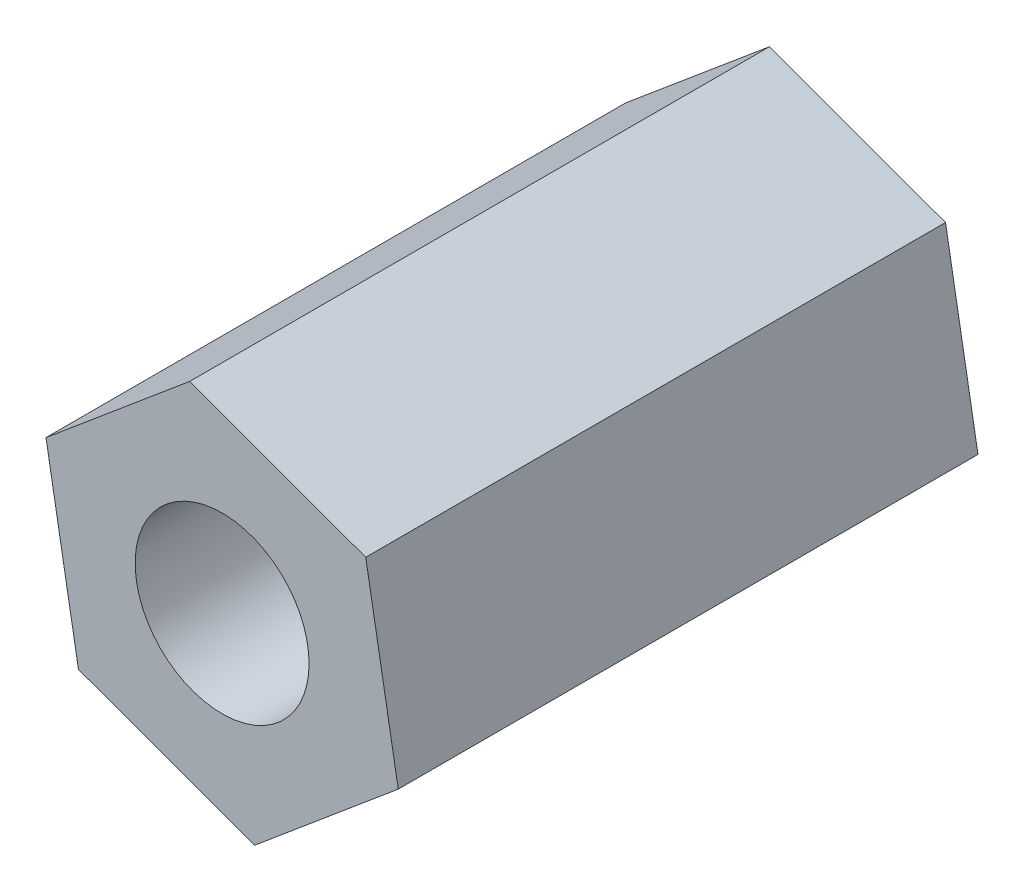
ISO-10303-21;
HEADER;
FILE_DESCRIPTION(('STEP AP214'),'2;1');
FILE_NAME('part.step','',(''),(''),'','','');
FILE_SCHEMA(('AUTOMOTIVE_DESIGN { 1 0 10303 214 1 1 1 1 }'));
ENDSEC;
DATA;
#1=APPLICATION_CONTEXT('core data for automotive mechanical design processes');
#2=APPLICATION_PROTOCOL_DEFINITION('international standard','automotive_design',2000,#1);
#3=PRODUCT_CONTEXT('',#1,'mechanical');
#4=PRODUCT('Part','Part','',(#3));
#5=PRODUCT_RELATED_PRODUCT_CATEGORY('part','',(#4));
#6=PRODUCT_DEFINITION_FORMATION('','',#4);
#7=PRODUCT_DEFINITION_CONTEXT('part definition',#1,'design');
#8=PRODUCT_DEFINITION('design','',#6,#7);
#9=PRODUCT_DEFINITION_SHAPE('','',#8);
#10=(LENGTH_UNIT() NAMED_UNIT(*) SI_UNIT(.MILLI.,.METRE.));
#11=(NAMED_UNIT(*) PLANE_ANGLE_UNIT() SI_UNIT($,.RADIAN.));
#12=(NAMED_UNIT(*) SI_UNIT($,.STERADIAN.) SOLID_ANGLE_UNIT());
#13=UNCERTAINTY_MEASURE_WITH_UNIT(LENGTH_MEASURE(1.E-05),#10,'distance_accuracy_value','');
#14=(GEOMETRIC_REPRESENTATION_CONTEXT(3) GLOBAL_UNCERTAINTY_ASSIGNED_CONTEXT((#13)) GLOBAL_UNIT_ASSIGNED_CONTEXT((#10,
#11,#12)) REPRESENTATION_CONTEXT('',''));
#15=CARTESIAN_POINT('',(0.,0.,0.));
#16=DIRECTION('',(0.,0.,1.));
#17=DIRECTION('',(1.,0.,0.));
#18=AXIS2_PLACEMENT_3D('',#15,#16,#17);
#19=CARTESIAN_POINT('',(0.,0.,10.));
#20=DIRECTION('',(0.,0.,1.));
#21=DIRECTION('',(1.,0.,0.));
#22=AXIS2_PLACEMENT_3D('',#19,#20,#21);
#23=PLANE('',#22);
#24=DIRECTION('',(0.939548933565756,-0.342414662997147,0.));
#25=VECTOR('',#24,1.);
#26=CARTESIAN_POINT('',(-132.779270137483,-55.9793424510125,10.));
#27=LINE('',#26,#25);
#28=CARTESIAN_POINT('',(-132.779270137483,-55.9793424510125,10.));
#29=VERTEX_POINT('',#28);
#30=CARTESIAN_POINT('',(-129.741556691102,-57.0864243590054,10.));
#31=VERTEX_POINT('',#30);
#32=EDGE_CURVE('E135',#29,#31,#27,.T.);
#33=ORIENTED_EDGE('',*,*,#32,.T.);
#34=DIRECTION('',(0.766314263566697,0.642465913067947,0.));
#35=VECTOR('',#34,1.);
#36=CARTESIAN_POINT('',(-129.741556691102,-57.0864243590054,10.));
#37=LINE('',#36,#35);
#38=CARTESIAN_POINT('',(-127.263938911519,-55.0092282990178,10.));
#39=VERTEX_POINT('',#38);
#40=EDGE_CURVE('E93',#31,#39,#37,.T.);
#41=ORIENTED_EDGE('',*,*,#40,.T.);
#42=DIRECTION('',(-0.173234669999057,0.984880576065097,0.));
#43=VECTOR('',#42,1.);
#44=CARTESIAN_POINT('',(-127.263938911519,-55.0092282990178,10.));
#45=LINE('',#44,#43);
#46=CARTESIAN_POINT('',(-127.824034578318,-51.8249503310372,10.));
#47=VERTEX_POINT('',#46);
#48=EDGE_CURVE('E106',#39,#47,#45,.T.);
#49=ORIENTED_EDGE('',*,*,#48,.T.);
#50=DIRECTION('',(-0.939548933565756,0.342414662997149,0.));
#51=VECTOR('',#50,1.);
#52=CARTESIAN_POINT('',(-127.824034578318,-51.8249503310372,10.));
#53=LINE('',#52,#51);
#54=CARTESIAN_POINT('',(-130.861748024699,-50.7178684230442,10.));
#55=VERTEX_POINT('',#54);
#56=EDGE_CURVE('E100',#47,#55,#53,.T.);
#57=ORIENTED_EDGE('',*,*,#56,.T.);
#58=DIRECTION('',(-0.766314263566692,-0.642465913067953,0.));
#59=VECTOR('',#58,1.);
#60=CARTESIAN_POINT('',(-130.861748024699,-50.7178684230442,10.));
#61=LINE('',#60,#59);
#62=CARTESIAN_POINT('',(-133.339365804282,-52.7950644830319,10.));
#63=VERTEX_POINT('',#62);
#64=EDGE_CURVE('E104',#55,#63,#61,.T.);
#65=ORIENTED_EDGE('',*,*,#64,.T.);
#66=DIRECTION('',(0.173234669999058,-0.984880576065097,0.));
#67=VECTOR('',#66,1.);
#68=CARTESIAN_POINT('',(-133.339365804282,-52.7950644830319,10.));
#69=LINE('',#68,#67);
#70=EDGE_CURVE('E56',#63,#29,#69,.T.);
#71=ORIENTED_EDGE('',*,*,#70,.T.);
#72=EDGE_LOOP('',(#33,#41,#49,#57,#65,#71));
#73=FACE_BOUND('',#72,.T.);
#74=CARTESIAN_POINT('',(-130.301652357901,-53.9021463910248,10.));
#75=DIRECTION('',(0.,0.,1.));
#76=DIRECTION('',(1.,0.,0.));
#77=AXIS2_PLACEMENT_3D('',#74,#75,#76);
#78=CIRCLE('',#77,1.5);
#79=CARTESIAN_POINT('',(-128.801652357901,-53.9021463910248,10.));
#80=VERTEX_POINT('',#79);
#81=EDGE_CURVE('E128',#80,#80,#78,.T.);
#82=ORIENTED_EDGE('',*,*,#81,.F.);
#83=EDGE_LOOP('',(#82));
#84=FACE_BOUND('',#83,.T.);
#85=ADVANCED_FACE('F39',(#73,#84),#23,.T.);
#86=CARTESIAN_POINT('',(0.,0.,0.));
#87=DIRECTION('',(0.,0.,1.));
#88=DIRECTION('',(1.,0.,0.));
#89=AXIS2_PLACEMENT_3D('',#86,#87,#88);
#90=PLANE('',#89);
#91=DIRECTION('',(0.939548933565756,-0.342414662997147,0.));
#92=VECTOR('',#91,1.);
#93=CARTESIAN_POINT('',(-132.779270137483,-55.9793424510125,0.));
#94=LINE('',#93,#92);
#95=CARTESIAN_POINT('',(-132.779270137483,-55.9793424510125,0.));
#96=VERTEX_POINT('',#95);
#97=CARTESIAN_POINT('',(-129.741556691102,-57.0864243590054,0.));
#98=VERTEX_POINT('',#97);
#99=EDGE_CURVE('E124',#96,#98,#94,.T.);
#100=ORIENTED_EDGE('',*,*,#99,.F.);
#101=DIRECTION('',(0.173234669999058,-0.984880576065097,0.));
#102=VECTOR('',#101,1.);
#103=CARTESIAN_POINT('',(-133.339365804282,-52.7950644830319,0.));
#104=LINE('',#103,#102);
#105=CARTESIAN_POINT('',(-133.339365804282,-52.7950644830319,0.));
#106=VERTEX_POINT('',#105);
#107=EDGE_CURVE('E85',#106,#96,#104,.T.);
#108=ORIENTED_EDGE('',*,*,#107,.F.);
#109=DIRECTION('',(-0.766314263566692,-0.642465913067953,0.));
#110=VECTOR('',#109,1.);
#111=CARTESIAN_POINT('',(-130.861748024699,-50.7178684230442,0.));
#112=LINE('',#111,#110);
#113=CARTESIAN_POINT('',(-130.861748024699,-50.7178684230442,0.));
#114=VERTEX_POINT('',#113);
#115=EDGE_CURVE('E79',#114,#106,#112,.T.);
#116=ORIENTED_EDGE('',*,*,#115,.F.);
#117=DIRECTION('',(-0.939548933565756,0.342414662997149,0.));
#118=VECTOR('',#117,1.);
#119=CARTESIAN_POINT('',(-127.824034578318,-51.8249503310372,0.));
#120=LINE('',#119,#118);
#121=CARTESIAN_POINT('',(-127.824034578318,-51.8249503310372,0.));
#122=VERTEX_POINT('',#121);
#123=EDGE_CURVE('E114',#122,#114,#120,.T.);
#124=ORIENTED_EDGE('',*,*,#123,.F.);
#125=DIRECTION('',(-0.173234669999057,0.984880576065097,0.));
#126=VECTOR('',#125,1.);
#127=CARTESIAN_POINT('',(-127.263938911519,-55.0092282990178,0.));
#128=LINE('',#127,#126);
#129=CARTESIAN_POINT('',(-127.263938911519,-55.0092282990178,0.));
#130=VERTEX_POINT('',#129);
#131=EDGE_CURVE('E130',#130,#122,#128,.T.);
#132=ORIENTED_EDGE('',*,*,#131,.F.);
#133=DIRECTION('',(0.766314263566697,0.642465913067947,0.));
#134=VECTOR('',#133,1.);
#135=CARTESIAN_POINT('',(-129.741556691102,-57.0864243590054,0.));
#136=LINE('',#135,#134);
#137=EDGE_CURVE('E127',#98,#130,#136,.T.);
#138=ORIENTED_EDGE('',*,*,#137,.F.);
#139=EDGE_LOOP('',(#100,#108,#116,#124,#132,#138));
#140=FACE_BOUND('',#139,.T.);
#141=CARTESIAN_POINT('',(-130.301652357901,-53.9021463910248,0.));
#142=DIRECTION('',(0.,0.,1.));
#143=DIRECTION('',(1.,0.,0.));
#144=AXIS2_PLACEMENT_3D('',#141,#142,#143);
#145=CIRCLE('',#144,1.5);
#146=CARTESIAN_POINT('',(-128.801652357901,-53.9021463910248,0.));
#147=VERTEX_POINT('',#146);
#148=EDGE_CURVE('E246',#147,#147,#145,.T.);
#149=ORIENTED_EDGE('',*,*,#148,.T.);
#150=EDGE_LOOP('',(#149));
#151=FACE_BOUND('',#150,.T.);
#152=ADVANCED_FACE('F144',(#140,#151),#90,.F.);
#153=CARTESIAN_POINT('',(-132.779270137483,-55.9793424510125,10.));
#154=DIRECTION('',(0.342414662997147,0.939548933565757,0.));
#155=DIRECTION('',(-0.939548933565757,0.342414662997147,0.));
#156=AXIS2_PLACEMENT_3D('',#153,#154,#155);
#157=PLANE('',#156);
#158=ORIENTED_EDGE('',*,*,#99,.T.);
#159=DIRECTION('',(0.,0.,-1.));
#160=VECTOR('',#159,1.);
#161=CARTESIAN_POINT('',(-129.741556691102,-57.0864243590054,10.));
#162=LINE('',#161,#160);
#163=EDGE_CURVE('E11',#31,#98,#162,.T.);
#164=ORIENTED_EDGE('',*,*,#163,.F.);
#165=ORIENTED_EDGE('',*,*,#32,.F.);
#166=DIRECTION('',(0.,0.,-1.));
#167=VECTOR('',#166,1.);
#168=CARTESIAN_POINT('',(-132.779270137483,-55.9793424510125,10.));
#169=LINE('',#168,#167);
#170=EDGE_CURVE('E120',#29,#96,#169,.T.);
#171=ORIENTED_EDGE('',*,*,#170,.T.);
#172=EDGE_LOOP('',(#158,#164,#165,#171));
#173=FACE_BOUND('',#172,.T.);
#174=ADVANCED_FACE('F41',(#173),#157,.F.);
#175=CARTESIAN_POINT('',(-129.741556691102,-57.0864243590054,10.));
#176=DIRECTION('',(-0.642465913067947,0.766314263566697,0.));
#177=DIRECTION('',(-0.766314263566697,-0.642465913067947,0.));
#178=AXIS2_PLACEMENT_3D('',#175,#176,#177);
#179=PLANE('',#178);
#180=ORIENTED_EDGE('',*,*,#137,.T.);
#181=DIRECTION('',(0.,0.,-1.));
#182=VECTOR('',#181,1.);
#183=CARTESIAN_POINT('',(-127.263938911519,-55.0092282990178,10.));
#184=LINE('',#183,#182);
#185=EDGE_CURVE('E48',#39,#130,#184,.T.);
#186=ORIENTED_EDGE('',*,*,#185,.F.);
#187=ORIENTED_EDGE('',*,*,#40,.F.);
#188=ORIENTED_EDGE('',*,*,#163,.T.);
#189=EDGE_LOOP('',(#180,#186,#187,#188));
#190=FACE_BOUND('',#189,.T.);
#191=ADVANCED_FACE('F169',(#190),#179,.F.);
#192=CARTESIAN_POINT('',(-127.263938911519,-55.0092282990178,10.));
#193=DIRECTION('',(-0.984880576065097,-0.173234669999057,0.));
#194=DIRECTION('',(0.173234669999057,-0.984880576065097,0.));
#195=AXIS2_PLACEMENT_3D('',#192,#193,#194);
#196=PLANE('',#195);
#197=ORIENTED_EDGE('',*,*,#131,.T.);
#198=DIRECTION('',(0.,0.,-1.));
#199=VECTOR('',#198,1.);
#200=CARTESIAN_POINT('',(-127.824034578318,-51.8249503310372,10.));
#201=LINE('',#200,#199);
#202=EDGE_CURVE('E115',#47,#122,#201,.T.);
#203=ORIENTED_EDGE('',*,*,#202,.F.);
#204=ORIENTED_EDGE('',*,*,#48,.F.);
#205=ORIENTED_EDGE('',*,*,#185,.T.);
#206=EDGE_LOOP('',(#197,#203,#204,#205));
#207=FACE_BOUND('',#206,.T.);
#208=ADVANCED_FACE('F141',(#207),#196,.F.);
#209=CARTESIAN_POINT('',(-127.824034578318,-51.8249503310372,10.));
#210=DIRECTION('',(-0.342414662997149,-0.939548933565756,0.));
#211=DIRECTION('',(0.939548933565756,-0.342414662997149,0.));
#212=AXIS2_PLACEMENT_3D('',#209,#210,#211);
#213=PLANE('',#212);
#214=ORIENTED_EDGE('',*,*,#123,.T.);
#215=DIRECTION('',(0.,0.,-1.));
#216=VECTOR('',#215,1.);
#217=CARTESIAN_POINT('',(-130.861748024699,-50.7178684230442,10.));
#218=LINE('',#217,#216);
#219=EDGE_CURVE('E111',#55,#114,#218,.T.);
#220=ORIENTED_EDGE('',*,*,#219,.F.);
#221=ORIENTED_EDGE('',*,*,#56,.F.);
#222=ORIENTED_EDGE('',*,*,#202,.T.);
#223=EDGE_LOOP('',(#214,#220,#221,#222));
#224=FACE_BOUND('',#223,.T.);
#225=ADVANCED_FACE('F112',(#224),#213,.F.);
#226=CARTESIAN_POINT('',(-130.861748024699,-50.7178684230442,10.));
#227=DIRECTION('',(0.642465913067953,-0.766314263566692,0.));
#228=DIRECTION('',(0.766314263566692,0.642465913067953,0.));
#229=AXIS2_PLACEMENT_3D('',#226,#227,#228);
#230=PLANE('',#229);
#231=ORIENTED_EDGE('',*,*,#115,.T.);
#232=DIRECTION('',(0.,0.,-1.));
#233=VECTOR('',#232,1.);
#234=CARTESIAN_POINT('',(-133.339365804282,-52.7950644830319,10.));
#235=LINE('',#234,#233);
#236=EDGE_CURVE('E116',#63,#106,#235,.T.);
#237=ORIENTED_EDGE('',*,*,#236,.F.);
#238=ORIENTED_EDGE('',*,*,#64,.F.);
#239=ORIENTED_EDGE('',*,*,#219,.T.);
#240=EDGE_LOOP('',(#231,#237,#238,#239));
#241=FACE_BOUND('',#240,.T.);
#242=ADVANCED_FACE('F118',(#241),#230,.F.);
#243=CARTESIAN_POINT('',(-133.339365804282,-52.7950644830319,10.));
#244=DIRECTION('',(0.984880576065097,0.173234669999058,0.));
#245=DIRECTION('',(-0.173234669999058,0.984880576065097,0.));
#246=AXIS2_PLACEMENT_3D('',#243,#244,#245);
#247=PLANE('',#246);
#248=ORIENTED_EDGE('',*,*,#107,.T.);
#249=ORIENTED_EDGE('',*,*,#170,.F.);
#250=ORIENTED_EDGE('',*,*,#70,.F.);
#251=ORIENTED_EDGE('',*,*,#236,.T.);
#252=EDGE_LOOP('',(#248,#249,#250,#251));
#253=FACE_BOUND('',#252,.T.);
#254=ADVANCED_FACE('F149',(#253),#247,.F.);
#255=CARTESIAN_POINT('',(-130.301652357901,-53.9021463910248,10.));
#256=DIRECTION('',(0.,0.,-1.));
#257=DIRECTION('',(-1.,0.,0.));
#258=AXIS2_PLACEMENT_3D('',#255,#256,#257);
#259=CYLINDRICAL_SURFACE('',#258,1.5);
#260=ORIENTED_EDGE('',*,*,#81,.T.);
#261=EDGE_LOOP('',(#260));
#262=FACE_BOUND('',#261,.T.);
#263=ORIENTED_EDGE('',*,*,#148,.F.);
#264=EDGE_LOOP('',(#263));
#265=FACE_BOUND('',#264,.T.);
#266=ADVANCED_FACE('F151',(#262,#265),#259,.F.);
#267=CLOSED_SHELL('',(#85,#152,#174,#191,#208,#225,#242,#254,#266));
#268=MANIFOLD_SOLID_BREP('B2',#267);
#269=ADVANCED_BREP_SHAPE_REPRESENTATION('',(#18,#268),#14);
#270=SHAPE_DEFINITION_REPRESENTATION(#9,#269);
ENDSEC;
END-ISO-10303-21;
